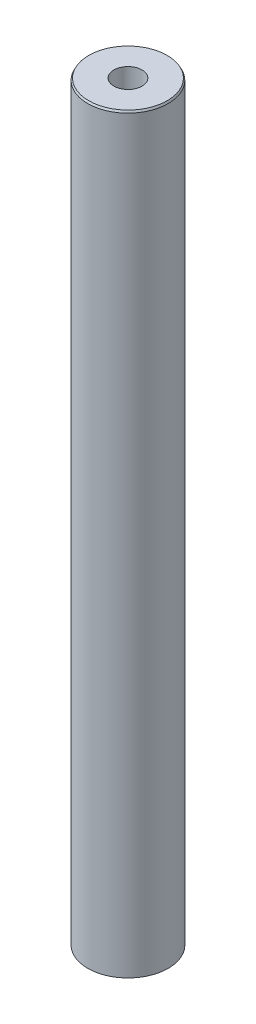
ISO-10303-21;
HEADER;
FILE_DESCRIPTION(('STEP AP214'),'2;1');
FILE_NAME('part.step','',(''),(''),'','','');
FILE_SCHEMA(('AUTOMOTIVE_DESIGN { 1 0 10303 214 1 1 1 1 }'));
ENDSEC;
DATA;
#1=APPLICATION_CONTEXT('core data for automotive mechanical design processes');
#2=APPLICATION_PROTOCOL_DEFINITION('international standard','automotive_design',2000,#1);
#3=PRODUCT_CONTEXT('',#1,'mechanical');
#4=PRODUCT('Part','Part','',(#3));
#5=PRODUCT_RELATED_PRODUCT_CATEGORY('part','',(#4));
#6=PRODUCT_DEFINITION_FORMATION('','',#4);
#7=PRODUCT_DEFINITION_CONTEXT('part definition',#1,'design');
#8=PRODUCT_DEFINITION('design','',#6,#7);
#9=PRODUCT_DEFINITION_SHAPE('','',#8);
#10=(LENGTH_UNIT() NAMED_UNIT(*) SI_UNIT(.MILLI.,.METRE.));
#11=(NAMED_UNIT(*) PLANE_ANGLE_UNIT() SI_UNIT($,.RADIAN.));
#12=(NAMED_UNIT(*) SI_UNIT($,.STERADIAN.) SOLID_ANGLE_UNIT());
#13=UNCERTAINTY_MEASURE_WITH_UNIT(LENGTH_MEASURE(1.E-05),#10,'distance_accuracy_value','');
#14=(GEOMETRIC_REPRESENTATION_CONTEXT(3) GLOBAL_UNCERTAINTY_ASSIGNED_CONTEXT((#13)) GLOBAL_UNIT_ASSIGNED_CONTEXT((#10,
#11,#12)) REPRESENTATION_CONTEXT('',''));
#15=CARTESIAN_POINT('',(0.,0.,0.));
#16=DIRECTION('',(0.,0.,1.));
#17=DIRECTION('',(1.,0.,0.));
#18=AXIS2_PLACEMENT_3D('',#15,#16,#17);
#19=CARTESIAN_POINT('',(0.,93.4415260662866,0.));
#20=DIRECTION('',(0.,-1.,0.));
#21=DIRECTION('',(0.,0.,-1.));
#22=AXIS2_PLACEMENT_3D('',#19,#20,#21);
#23=CYLINDRICAL_SURFACE('',#22,5.);
#24=CARTESIAN_POINT('',(0.,93.1957243727675,0.));
#25=DIRECTION('',(0.,1.,0.));
#26=DIRECTION('',(0.,0.,1.));
#27=AXIS2_PLACEMENT_3D('',#24,#25,#26);
#28=CIRCLE('',#27,5.);
#29=CARTESIAN_POINT('',(0.,93.1957243727675,5.));
#30=VERTEX_POINT('',#29);
#31=EDGE_CURVE('E50',#30,#30,#28,.F.);
#32=ORIENTED_EDGE('',*,*,#31,.T.);
#33=EDGE_LOOP('',(#32));
#34=FACE_BOUND('',#33,.T.);
#35=CARTESIAN_POINT('',(0.,0.122696255406229,0.));
#36=DIRECTION('',(0.,1.,0.));
#37=DIRECTION('',(0.,0.,1.));
#38=AXIS2_PLACEMENT_3D('',#35,#36,#37);
#39=CIRCLE('',#38,5.);
#40=CARTESIAN_POINT('',(0.,0.122696255406229,5.));
#41=VERTEX_POINT('',#40);
#42=EDGE_CURVE('E51',#41,#41,#39,.T.);
#43=ORIENTED_EDGE('',*,*,#42,.T.);
#44=EDGE_LOOP('',(#43));
#45=FACE_BOUND('',#44,.T.);
#46=ADVANCED_FACE('F39',(#34,#45),#23,.T.);
#47=CARTESIAN_POINT('',(0.,93.4415260662866,0.));
#48=DIRECTION('',(0.,1.,0.));
#49=DIRECTION('',(0.,0.,1.));
#50=AXIS2_PLACEMENT_3D('',#47,#48,#49);
#51=PLANE('',#50);
#52=CARTESIAN_POINT('',(0.,93.4415260662866,0.));
#53=DIRECTION('',(0.,1.,0.));
#54=DIRECTION('',(0.,0.,1.));
#55=AXIS2_PLACEMENT_3D('',#52,#53,#54);
#56=CIRCLE('',#55,4.87730374459374);
#57=CARTESIAN_POINT('',(0.,93.4415260662866,4.87730374459374));
#58=VERTEX_POINT('',#57);
#59=EDGE_CURVE('E54',#58,#58,#56,.T.);
#60=ORIENTED_EDGE('',*,*,#59,.T.);
#61=EDGE_LOOP('',(#60));
#62=FACE_BOUND('',#61,.T.);
#63=CARTESIAN_POINT('',(0.,93.4415260662866,0.));
#64=DIRECTION('',(0.,1.,0.));
#65=DIRECTION('',(0.,0.,1.));
#66=AXIS2_PLACEMENT_3D('',#63,#64,#65);
#67=CIRCLE('',#66,1.74819534445496);
#68=CARTESIAN_POINT('',(0.,93.4415260662866,1.74819534445496));
#69=VERTEX_POINT('',#68);
#70=EDGE_CURVE('E58',#69,#69,#67,.T.);
#71=ORIENTED_EDGE('',*,*,#70,.F.);
#72=EDGE_LOOP('',(#71));
#73=FACE_BOUND('',#72,.T.);
#74=ADVANCED_FACE('F69',(#62,#73),#51,.T.);
#75=CARTESIAN_POINT('',(0.,0.,0.));
#76=DIRECTION('',(0.,1.,0.));
#77=DIRECTION('',(0.,0.,1.));
#78=AXIS2_PLACEMENT_3D('',#75,#76,#77);
#79=PLANE('',#78);
#80=CARTESIAN_POINT('',(0.,0.,0.));
#81=DIRECTION('',(0.,1.,0.));
#82=DIRECTION('',(0.,0.,1.));
#83=AXIS2_PLACEMENT_3D('',#80,#81,#82);
#84=CIRCLE('',#83,4.75419830648095);
#85=CARTESIAN_POINT('',(0.,0.,4.75419830648095));
#86=VERTEX_POINT('',#85);
#87=EDGE_CURVE('E10',#86,#86,#84,.F.);
#88=ORIENTED_EDGE('',*,*,#87,.T.);
#89=EDGE_LOOP('',(#88));
#90=FACE_BOUND('',#89,.T.);
#91=CARTESIAN_POINT('',(0.,0.,0.));
#92=DIRECTION('',(0.,1.,0.));
#93=DIRECTION('',(0.,0.,1.));
#94=AXIS2_PLACEMENT_3D('',#91,#92,#93);
#95=CIRCLE('',#94,1.74819534445496);
#96=CARTESIAN_POINT('',(0.,0.,1.74819534445496));
#97=VERTEX_POINT('',#96);
#98=EDGE_CURVE('E63',#97,#97,#95,.T.);
#99=ORIENTED_EDGE('',*,*,#98,.T.);
#100=EDGE_LOOP('',(#99));
#101=FACE_BOUND('',#100,.T.);
#102=ADVANCED_FACE('F75',(#90,#101),#79,.F.);
#103=CARTESIAN_POINT('',(0.,93.4415260662866,0.));
#104=DIRECTION('',(0.,-1.,0.));
#105=DIRECTION('',(0.,0.,-1.));
#106=AXIS2_PLACEMENT_3D('',#103,#104,#105);
#107=CYLINDRICAL_SURFACE('',#106,1.74819534445496);
#108=ORIENTED_EDGE('',*,*,#70,.T.);
#109=EDGE_LOOP('',(#108));
#110=FACE_BOUND('',#109,.T.);
#111=ORIENTED_EDGE('',*,*,#98,.F.);
#112=EDGE_LOOP('',(#111));
#113=FACE_BOUND('',#112,.T.);
#114=ADVANCED_FACE('F70',(#110,#113),#107,.F.);
#115=CARTESIAN_POINT('',(0.,93.4415260662866,0.));
#116=DIRECTION('',(0.,-1.,0.));
#117=DIRECTION('',(0.,0.,-1.));
#118=AXIS2_PLACEMENT_3D('',#115,#116,#117);
#119=CONICAL_SURFACE('',#118,4.87730374459374,0.462981512819377);
#120=ORIENTED_EDGE('',*,*,#31,.F.);
#121=EDGE_LOOP('',(#120));
#122=FACE_BOUND('',#121,.T.);
#123=ORIENTED_EDGE('',*,*,#59,.F.);
#124=EDGE_LOOP('',(#123));
#125=FACE_BOUND('',#124,.T.);
#126=ADVANCED_FACE('F81',(#122,#125),#119,.T.);
#127=CARTESIAN_POINT('',(0.,0.122696255406229,0.));
#128=DIRECTION('',(0.,1.,0.));
#129=DIRECTION('',(0.,0.,1.));
#130=AXIS2_PLACEMENT_3D('',#127,#128,#129);
#131=CONICAL_SURFACE('',#130,5.,1.1078148139755);
#132=ORIENTED_EDGE('',*,*,#87,.F.);
#133=EDGE_LOOP('',(#132));
#134=FACE_BOUND('',#133,.T.);
#135=ORIENTED_EDGE('',*,*,#42,.F.);
#136=EDGE_LOOP('',(#135));
#137=FACE_BOUND('',#136,.T.);
#138=ADVANCED_FACE('F45',(#134,#137),#131,.T.);
#139=CLOSED_SHELL('',(#46,#74,#102,#114,#126,#138));
#140=MANIFOLD_SOLID_BREP('B2',#139);
#141=ADVANCED_BREP_SHAPE_REPRESENTATION('',(#18,#140),#14);
#142=SHAPE_DEFINITION_REPRESENTATION(#9,#141);
ENDSEC;
END-ISO-10303-21;
